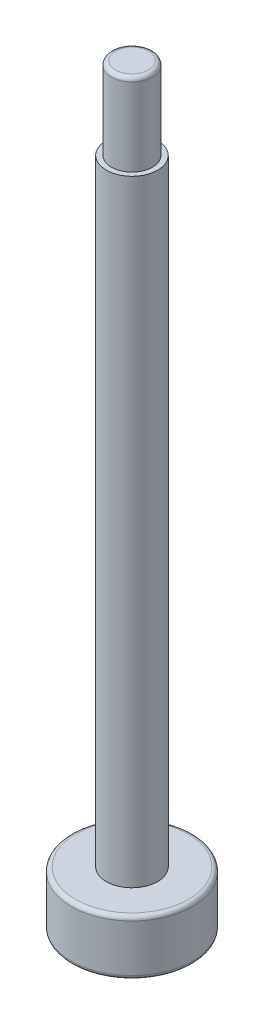
ISO-10303-21;
HEADER;
FILE_DESCRIPTION(('STEP AP214'),'2;1');
FILE_NAME('part.step','',(''),(''),'','','');
FILE_SCHEMA(('AUTOMOTIVE_DESIGN { 1 0 10303 214 1 1 1 1 }'));
ENDSEC;
DATA;
#1=APPLICATION_CONTEXT('core data for automotive mechanical design processes');
#2=APPLICATION_PROTOCOL_DEFINITION('international standard','automotive_design',2000,#1);
#3=PRODUCT_CONTEXT('',#1,'mechanical');
#4=PRODUCT('Part','Part','',(#3));
#5=PRODUCT_RELATED_PRODUCT_CATEGORY('part','',(#4));
#6=PRODUCT_DEFINITION_FORMATION('','',#4);
#7=PRODUCT_DEFINITION_CONTEXT('part definition',#1,'design');
#8=PRODUCT_DEFINITION('design','',#6,#7);
#9=PRODUCT_DEFINITION_SHAPE('','',#8);
#10=(LENGTH_UNIT() NAMED_UNIT(*) SI_UNIT(.MILLI.,.METRE.));
#11=(NAMED_UNIT(*) PLANE_ANGLE_UNIT() SI_UNIT($,.RADIAN.));
#12=(NAMED_UNIT(*) SI_UNIT($,.STERADIAN.) SOLID_ANGLE_UNIT());
#13=UNCERTAINTY_MEASURE_WITH_UNIT(LENGTH_MEASURE(1.E-05),#10,'distance_accuracy_value','');
#14=(GEOMETRIC_REPRESENTATION_CONTEXT(3) GLOBAL_UNCERTAINTY_ASSIGNED_CONTEXT((#13)) GLOBAL_UNIT_ASSIGNED_CONTEXT((#10,
#11,#12)) REPRESENTATION_CONTEXT('',''));
#15=CARTESIAN_POINT('',(0.,0.,0.));
#16=DIRECTION('',(0.,0.,1.));
#17=DIRECTION('',(1.,0.,0.));
#18=AXIS2_PLACEMENT_3D('',#15,#16,#17);
#19=CARTESIAN_POINT('',(0.,2.7,0.));
#20=DIRECTION('',(0.,-1.,0.));
#21=DIRECTION('',(0.,0.,-1.));
#22=AXIS2_PLACEMENT_3D('',#19,#20,#21);
#23=CYLINDRICAL_SURFACE('',#22,2.95);
#24=CARTESIAN_POINT('',(0.,0.2,0.));
#25=DIRECTION('',(0.,1.,0.));
#26=DIRECTION('',(0.,0.,1.));
#27=AXIS2_PLACEMENT_3D('',#24,#25,#26);
#28=CIRCLE('',#27,2.95);
#29=CARTESIAN_POINT('',(0.,0.2,2.95));
#30=VERTEX_POINT('',#29);
#31=EDGE_CURVE('E158',#30,#30,#28,.T.);
#32=ORIENTED_EDGE('',*,*,#31,.T.);
#33=EDGE_LOOP('',(#32));
#34=FACE_BOUND('',#33,.T.);
#35=CARTESIAN_POINT('',(0.,2.5,0.));
#36=DIRECTION('',(0.,1.,0.));
#37=DIRECTION('',(0.,0.,1.));
#38=AXIS2_PLACEMENT_3D('',#35,#36,#37);
#39=CIRCLE('',#38,2.95);
#40=CARTESIAN_POINT('',(0.,2.5,2.95));
#41=VERTEX_POINT('',#40);
#42=EDGE_CURVE('E150',#41,#41,#39,.F.);
#43=ORIENTED_EDGE('',*,*,#42,.T.);
#44=EDGE_LOOP('',(#43));
#45=FACE_BOUND('',#44,.T.);
#46=ADVANCED_FACE('F39',(#34,#45),#23,.T.);
#47=CARTESIAN_POINT('',(0.,2.7,0.));
#48=DIRECTION('',(0.,1.,0.));
#49=DIRECTION('',(0.,0.,1.));
#50=AXIS2_PLACEMENT_3D('',#47,#48,#49);
#51=PLANE('',#50);
#52=CARTESIAN_POINT('',(0.,2.7,0.));
#53=DIRECTION('',(0.,1.,0.));
#54=DIRECTION('',(0.,0.,1.));
#55=AXIS2_PLACEMENT_3D('',#52,#53,#54);
#56=CIRCLE('',#55,2.75);
#57=CARTESIAN_POINT('',(0.,2.7,2.75));
#58=VERTEX_POINT('',#57);
#59=EDGE_CURVE('E164',#58,#58,#56,.T.);
#60=ORIENTED_EDGE('',*,*,#59,.T.);
#61=EDGE_LOOP('',(#60));
#62=FACE_BOUND('',#61,.T.);
#63=CARTESIAN_POINT('',(0.,2.7,0.));
#64=DIRECTION('',(0.,1.,0.));
#65=DIRECTION('',(0.,0.,1.));
#66=AXIS2_PLACEMENT_3D('',#63,#64,#65);
#67=CIRCLE('',#66,1.25);
#68=CARTESIAN_POINT('',(0.,2.7,1.25));
#69=VERTEX_POINT('',#68);
#70=EDGE_CURVE('E151',#69,#69,#67,.T.);
#71=ORIENTED_EDGE('',*,*,#70,.F.);
#72=EDGE_LOOP('',(#71));
#73=FACE_BOUND('',#72,.T.);
#74=ADVANCED_FACE('F181',(#62,#73),#51,.T.);
#75=CARTESIAN_POINT('',(0.,0.,0.));
#76=DIRECTION('',(0.,1.,0.));
#77=DIRECTION('',(0.,0.,1.));
#78=AXIS2_PLACEMENT_3D('',#75,#76,#77);
#79=PLANE('',#78);
#80=CARTESIAN_POINT('',(0.,0.,0.));
#81=DIRECTION('',(0.,1.,0.));
#82=DIRECTION('',(0.,0.,1.));
#83=AXIS2_PLACEMENT_3D('',#80,#81,#82);
#84=CIRCLE('',#83,2.75);
#85=CARTESIAN_POINT('',(0.,0.,2.75));
#86=VERTEX_POINT('',#85);
#87=EDGE_CURVE('E161',#86,#86,#84,.F.);
#88=ORIENTED_EDGE('',*,*,#87,.T.);
#89=EDGE_LOOP('',(#88));
#90=FACE_BOUND('',#89,.T.);
#91=DIRECTION('',(-0.28704549437819,0.,0.95791695055322));
#92=VECTOR('',#91,1.);
#93=CARTESIAN_POINT('',(2.24728548800427,0.,-0.532016229770034));
#94=LINE('',#93,#92);
#95=CARTESIAN_POINT('',(2.24728548800427,0.,-0.532016229770034));
#96=VERTEX_POINT('',#95);
#97=CARTESIAN_POINT('',(1.58438231420861,0.,1.68019820728279));
#98=VERTEX_POINT('',#97);
#99=EDGE_CURVE('E128',#96,#98,#94,.T.);
#100=ORIENTED_EDGE('',*,*,#99,.F.);
#101=DIRECTION('',(0.686057666705715,0.,0.727547165449986));
#102=VECTOR('',#101,1.);
#103=CARTESIAN_POINT('',(0.662903173795668,0.,-2.21221443705283));
#104=LINE('',#103,#102);
#105=CARTESIAN_POINT('',(0.662903173795668,0.,-2.21221443705283));
#106=VERTEX_POINT('',#105);
#107=EDGE_CURVE('E54',#106,#96,#104,.T.);
#108=ORIENTED_EDGE('',*,*,#107,.F.);
#109=DIRECTION('',(0.973103161083906,0.,-0.230369785103234));
#110=VECTOR('',#109,1.);
#111=CARTESIAN_POINT('',(-1.58438231420861,0.,-1.68019820728279));
#112=LINE('',#111,#110);
#113=CARTESIAN_POINT('',(-1.58438231420861,0.,-1.68019820728279));
#114=VERTEX_POINT('',#113);
#115=EDGE_CURVE('E137',#114,#106,#112,.T.);
#116=ORIENTED_EDGE('',*,*,#115,.F.);
#117=DIRECTION('',(0.28704549437819,0.,-0.95791695055322));
#118=VECTOR('',#117,1.);
#119=CARTESIAN_POINT('',(-2.24728548800427,0.,0.532016229770034));
#120=LINE('',#119,#118);
#121=CARTESIAN_POINT('',(-2.24728548800427,0.,0.532016229770034));
#122=VERTEX_POINT('',#121);
#123=EDGE_CURVE('E135',#122,#114,#120,.T.);
#124=ORIENTED_EDGE('',*,*,#123,.F.);
#125=DIRECTION('',(-0.686057666705716,0.,-0.727547165449986));
#126=VECTOR('',#125,1.);
#127=CARTESIAN_POINT('',(-0.662903173795669,0.,2.21221443705283));
#128=LINE('',#127,#126);
#129=CARTESIAN_POINT('',(-0.662903173795669,0.,2.21221443705283));
#130=VERTEX_POINT('',#129);
#131=EDGE_CURVE('E102',#130,#122,#128,.T.);
#132=ORIENTED_EDGE('',*,*,#131,.F.);
#133=DIRECTION('',(-0.973103161083906,0.,0.230369785103234));
#134=VECTOR('',#133,1.);
#135=CARTESIAN_POINT('',(1.58438231420861,0.,1.68019820728279));
#136=LINE('',#135,#134);
#137=EDGE_CURVE('E131',#98,#130,#136,.T.);
#138=ORIENTED_EDGE('',*,*,#137,.F.);
#139=EDGE_LOOP('',(#100,#108,#116,#124,#132,#138));
#140=FACE_BOUND('',#139,.T.);
#141=ADVANCED_FACE('F187',(#90,#140),#79,.F.);
#142=CARTESIAN_POINT('',(0.,32.7,0.));
#143=DIRECTION('',(0.,-1.,0.));
#144=DIRECTION('',(0.,0.,-1.));
#145=AXIS2_PLACEMENT_3D('',#142,#143,#144);
#146=CYLINDRICAL_SURFACE('',#145,1.25);
#147=CARTESIAN_POINT('',(0.,32.7,0.));
#148=DIRECTION('',(0.,1.,0.));
#149=DIRECTION('',(0.,0.,1.));
#150=AXIS2_PLACEMENT_3D('',#147,#148,#149);
#151=CIRCLE('',#150,1.25);
#152=CARTESIAN_POINT('',(0.,32.7,1.25));
#153=VERTEX_POINT('',#152);
#154=EDGE_CURVE('E141',#153,#153,#151,.T.);
#155=ORIENTED_EDGE('',*,*,#154,.F.);
#156=EDGE_LOOP('',(#155));
#157=FACE_BOUND('',#156,.T.);
#158=ORIENTED_EDGE('',*,*,#70,.T.);
#159=EDGE_LOOP('',(#158));
#160=FACE_BOUND('',#159,.T.);
#161=ADVANCED_FACE('F206',(#157,#160),#146,.T.);
#162=CARTESIAN_POINT('',(0.,32.7,0.));
#163=DIRECTION('',(0.,1.,0.));
#164=DIRECTION('',(0.,0.,1.));
#165=AXIS2_PLACEMENT_3D('',#162,#163,#164);
#166=PLANE('',#165);
#167=CARTESIAN_POINT('',(0.,32.7,0.));
#168=DIRECTION('',(0.,1.,0.));
#169=DIRECTION('',(0.,0.,1.));
#170=AXIS2_PLACEMENT_3D('',#167,#168,#169);
#171=CIRCLE('',#170,1.);
#172=CARTESIAN_POINT('',(0.,32.7,1.));
#173=VERTEX_POINT('',#172);
#174=EDGE_CURVE('E147',#173,#173,#171,.T.);
#175=ORIENTED_EDGE('',*,*,#174,.F.);
#176=EDGE_LOOP('',(#175));
#177=FACE_BOUND('',#176,.T.);
#178=ORIENTED_EDGE('',*,*,#154,.T.);
#179=EDGE_LOOP('',(#178));
#180=FACE_BOUND('',#179,.T.);
#181=ADVANCED_FACE('F228',(#177,#180),#166,.T.);
#182=CARTESIAN_POINT('',(0.,36.7,0.));
#183=DIRECTION('',(0.,-1.,0.));
#184=DIRECTION('',(0.,0.,-1.));
#185=AXIS2_PLACEMENT_3D('',#182,#183,#184);
#186=CYLINDRICAL_SURFACE('',#185,1.);
#187=CARTESIAN_POINT('',(0.,36.5,0.));
#188=DIRECTION('',(0.,1.,0.));
#189=DIRECTION('',(0.,0.,1.));
#190=AXIS2_PLACEMENT_3D('',#187,#188,#189);
#191=CIRCLE('',#190,1.);
#192=CARTESIAN_POINT('',(0.,36.5,1.));
#193=VERTEX_POINT('',#192);
#194=EDGE_CURVE('E11',#193,#193,#191,.F.);
#195=ORIENTED_EDGE('',*,*,#194,.T.);
#196=EDGE_LOOP('',(#195));
#197=FACE_BOUND('',#196,.T.);
#198=ORIENTED_EDGE('',*,*,#174,.T.);
#199=EDGE_LOOP('',(#198));
#200=FACE_BOUND('',#199,.T.);
#201=ADVANCED_FACE('F221',(#197,#200),#186,.T.);
#202=CARTESIAN_POINT('',(0.,36.7,0.));
#203=DIRECTION('',(0.,1.,0.));
#204=DIRECTION('',(0.,0.,1.));
#205=AXIS2_PLACEMENT_3D('',#202,#203,#204);
#206=PLANE('',#205);
#207=CARTESIAN_POINT('',(0.,36.7,0.));
#208=DIRECTION('',(0.,1.,0.));
#209=DIRECTION('',(0.,0.,1.));
#210=AXIS2_PLACEMENT_3D('',#207,#208,#209);
#211=CIRCLE('',#210,0.8);
#212=CARTESIAN_POINT('',(0.,36.7,0.8));
#213=VERTEX_POINT('',#212);
#214=EDGE_CURVE('E47',#213,#213,#211,.T.);
#215=ORIENTED_EDGE('',*,*,#214,.T.);
#216=EDGE_LOOP('',(#215));
#217=FACE_BOUND('',#216,.T.);
#218=ADVANCED_FACE('F169',(#217),#206,.T.);
#219=CARTESIAN_POINT('',(0.662903173795668,2.,-2.21221443705283));
#220=DIRECTION('',(0.727547165449986,0.,-0.686057666705715));
#221=DIRECTION('',(-0.686057666705716,0.,-0.727547165449986));
#222=AXIS2_PLACEMENT_3D('',#219,#220,#221);
#223=PLANE('',#222);
#224=ORIENTED_EDGE('',*,*,#107,.T.);
#225=DIRECTION('',(0.,-1.,0.));
#226=VECTOR('',#225,1.);
#227=CARTESIAN_POINT('',(2.24728548800427,2.,-0.532016229770034));
#228=LINE('',#227,#226);
#229=CARTESIAN_POINT('',(2.24728548800427,2.,-0.532016229770034));
#230=VERTEX_POINT('',#229);
#231=EDGE_CURVE('E84',#230,#96,#228,.T.);
#232=ORIENTED_EDGE('',*,*,#231,.F.);
#233=DIRECTION('',(0.686057666705715,0.,0.727547165449986));
#234=VECTOR('',#233,1.);
#235=CARTESIAN_POINT('',(0.662903173795668,2.,-2.21221443705283));
#236=LINE('',#235,#234);
#237=CARTESIAN_POINT('',(0.662903173795668,2.,-2.21221443705283));
#238=VERTEX_POINT('',#237);
#239=EDGE_CURVE('E139',#238,#230,#236,.T.);
#240=ORIENTED_EDGE('',*,*,#239,.F.);
#241=DIRECTION('',(0.,-1.,0.));
#242=VECTOR('',#241,1.);
#243=CARTESIAN_POINT('',(0.662903173795668,2.,-2.21221443705283));
#244=LINE('',#243,#242);
#245=EDGE_CURVE('E62',#238,#106,#244,.T.);
#246=ORIENTED_EDGE('',*,*,#245,.T.);
#247=EDGE_LOOP('',(#224,#232,#240,#246));
#248=FACE_BOUND('',#247,.T.);
#249=ADVANCED_FACE('F212',(#248),#223,.F.);
#250=CARTESIAN_POINT('',(-1.58438231420861,2.,-1.68019820728279));
#251=DIRECTION('',(-0.230369785103234,0.,-0.973103161083906));
#252=DIRECTION('',(-0.973103161083906,0.,0.230369785103234));
#253=AXIS2_PLACEMENT_3D('',#250,#251,#252);
#254=PLANE('',#253);
#255=ORIENTED_EDGE('',*,*,#115,.T.);
#256=ORIENTED_EDGE('',*,*,#245,.F.);
#257=DIRECTION('',(0.973103161083906,0.,-0.230369785103234));
#258=VECTOR('',#257,1.);
#259=CARTESIAN_POINT('',(-1.58438231420861,2.,-1.68019820728279));
#260=LINE('',#259,#258);
#261=CARTESIAN_POINT('',(-1.58438231420861,2.,-1.68019820728279));
#262=VERTEX_POINT('',#261);
#263=EDGE_CURVE('E114',#262,#238,#260,.T.);
#264=ORIENTED_EDGE('',*,*,#263,.F.);
#265=DIRECTION('',(0.,-1.,0.));
#266=VECTOR('',#265,1.);
#267=CARTESIAN_POINT('',(-1.58438231420861,2.,-1.68019820728279));
#268=LINE('',#267,#266);
#269=EDGE_CURVE('E106',#262,#114,#268,.T.);
#270=ORIENTED_EDGE('',*,*,#269,.T.);
#271=EDGE_LOOP('',(#255,#256,#264,#270));
#272=FACE_BOUND('',#271,.T.);
#273=ADVANCED_FACE('F214',(#272),#254,.F.);
#274=CARTESIAN_POINT('',(-2.24728548800427,2.,0.532016229770034));
#275=DIRECTION('',(-0.95791695055322,0.,-0.28704549437819));
#276=DIRECTION('',(-0.28704549437819,0.,0.95791695055322));
#277=AXIS2_PLACEMENT_3D('',#274,#275,#276);
#278=PLANE('',#277);
#279=ORIENTED_EDGE('',*,*,#123,.T.);
#280=ORIENTED_EDGE('',*,*,#269,.F.);
#281=DIRECTION('',(0.28704549437819,0.,-0.95791695055322));
#282=VECTOR('',#281,1.);
#283=CARTESIAN_POINT('',(-2.24728548800427,2.,0.532016229770034));
#284=LINE('',#283,#282);
#285=CARTESIAN_POINT('',(-2.24728548800427,2.,0.532016229770034));
#286=VERTEX_POINT('',#285);
#287=EDGE_CURVE('E110',#286,#262,#284,.T.);
#288=ORIENTED_EDGE('',*,*,#287,.F.);
#289=DIRECTION('',(0.,-1.,0.));
#290=VECTOR('',#289,1.);
#291=CARTESIAN_POINT('',(-2.24728548800427,2.,0.532016229770034));
#292=LINE('',#291,#290);
#293=EDGE_CURVE('E95',#286,#122,#292,.T.);
#294=ORIENTED_EDGE('',*,*,#293,.T.);
#295=EDGE_LOOP('',(#279,#280,#288,#294));
#296=FACE_BOUND('',#295,.T.);
#297=ADVANCED_FACE('F111',(#296),#278,.F.);
#298=CARTESIAN_POINT('',(-0.662903173795669,2.,2.21221443705283));
#299=DIRECTION('',(-0.727547165449986,0.,0.686057666705716));
#300=DIRECTION('',(0.686057666705716,0.,0.727547165449986));
#301=AXIS2_PLACEMENT_3D('',#298,#299,#300);
#302=PLANE('',#301);
#303=ORIENTED_EDGE('',*,*,#131,.T.);
#304=ORIENTED_EDGE('',*,*,#293,.F.);
#305=DIRECTION('',(-0.686057666705716,0.,-0.727547165449986));
#306=VECTOR('',#305,1.);
#307=CARTESIAN_POINT('',(-0.662903173795669,2.,2.21221443705283));
#308=LINE('',#307,#306);
#309=CARTESIAN_POINT('',(-0.662903173795669,2.,2.21221443705283));
#310=VERTEX_POINT('',#309);
#311=EDGE_CURVE('E99',#310,#286,#308,.T.);
#312=ORIENTED_EDGE('',*,*,#311,.F.);
#313=DIRECTION('',(0.,-1.,0.));
#314=VECTOR('',#313,1.);
#315=CARTESIAN_POINT('',(-0.662903173795669,2.,2.21221443705283));
#316=LINE('',#315,#314);
#317=EDGE_CURVE('E107',#310,#130,#316,.T.);
#318=ORIENTED_EDGE('',*,*,#317,.T.);
#319=EDGE_LOOP('',(#303,#304,#312,#318));
#320=FACE_BOUND('',#319,.T.);
#321=ADVANCED_FACE('F97',(#320),#302,.F.);
#322=CARTESIAN_POINT('',(1.58438231420861,2.,1.68019820728279));
#323=DIRECTION('',(0.230369785103234,0.,0.973103161083906));
#324=DIRECTION('',(0.973103161083906,0.,-0.230369785103234));
#325=AXIS2_PLACEMENT_3D('',#322,#323,#324);
#326=PLANE('',#325);
#327=ORIENTED_EDGE('',*,*,#137,.T.);
#328=ORIENTED_EDGE('',*,*,#317,.F.);
#329=DIRECTION('',(-0.973103161083906,0.,0.230369785103234));
#330=VECTOR('',#329,1.);
#331=CARTESIAN_POINT('',(1.58438231420861,2.,1.68019820728279));
#332=LINE('',#331,#330);
#333=CARTESIAN_POINT('',(1.58438231420861,2.,1.68019820728279));
#334=VERTEX_POINT('',#333);
#335=EDGE_CURVE('E120',#334,#310,#332,.T.);
#336=ORIENTED_EDGE('',*,*,#335,.F.);
#337=DIRECTION('',(0.,-1.,0.));
#338=VECTOR('',#337,1.);
#339=CARTESIAN_POINT('',(1.58438231420861,2.,1.68019820728279));
#340=LINE('',#339,#338);
#341=EDGE_CURVE('E144',#334,#98,#340,.T.);
#342=ORIENTED_EDGE('',*,*,#341,.T.);
#343=EDGE_LOOP('',(#327,#328,#336,#342));
#344=FACE_BOUND('',#343,.T.);
#345=ADVANCED_FACE('F286',(#344),#326,.F.);
#346=CARTESIAN_POINT('',(2.24728548800427,2.,-0.532016229770034));
#347=DIRECTION('',(0.95791695055322,0.,0.28704549437819));
#348=DIRECTION('',(0.28704549437819,0.,-0.95791695055322));
#349=AXIS2_PLACEMENT_3D('',#346,#347,#348);
#350=PLANE('',#349);
#351=ORIENTED_EDGE('',*,*,#99,.T.);
#352=ORIENTED_EDGE('',*,*,#341,.F.);
#353=DIRECTION('',(-0.28704549437819,0.,0.95791695055322));
#354=VECTOR('',#353,1.);
#355=CARTESIAN_POINT('',(2.24728548800427,2.,-0.532016229770034));
#356=LINE('',#355,#354);
#357=EDGE_CURVE('E122',#230,#334,#356,.T.);
#358=ORIENTED_EDGE('',*,*,#357,.F.);
#359=ORIENTED_EDGE('',*,*,#231,.T.);
#360=EDGE_LOOP('',(#351,#352,#358,#359));
#361=FACE_BOUND('',#360,.T.);
#362=ADVANCED_FACE('F198',(#361),#350,.F.);
#363=CARTESIAN_POINT('',(0.,2.,0.));
#364=DIRECTION('',(0.,-1.,0.));
#365=DIRECTION('',(0.,0.,-1.));
#366=AXIS2_PLACEMENT_3D('',#363,#364,#365);
#367=PLANE('',#366);
#368=ORIENTED_EDGE('',*,*,#239,.T.);
#369=ORIENTED_EDGE('',*,*,#357,.T.);
#370=ORIENTED_EDGE('',*,*,#335,.T.);
#371=ORIENTED_EDGE('',*,*,#311,.T.);
#372=ORIENTED_EDGE('',*,*,#287,.T.);
#373=ORIENTED_EDGE('',*,*,#263,.T.);
#374=EDGE_LOOP('',(#368,#369,#370,#371,#372,#373));
#375=FACE_BOUND('',#374,.T.);
#376=ADVANCED_FACE('F117',(#375),#367,.T.);
#377=CARTESIAN_POINT('',(0.,0.2,0.));
#378=DIRECTION('',(0.,1.,0.));
#379=DIRECTION('',(0.,0.,1.));
#380=AXIS2_PLACEMENT_3D('',#377,#378,#379);
#381=TOROIDAL_SURFACE('',#380,2.75,0.2);
#382=ORIENTED_EDGE('',*,*,#87,.F.);
#383=EDGE_LOOP('',(#382));
#384=FACE_BOUND('',#383,.T.);
#385=ORIENTED_EDGE('',*,*,#31,.F.);
#386=EDGE_LOOP('',(#385));
#387=FACE_BOUND('',#386,.T.);
#388=ADVANCED_FACE('F177',(#384,#387),#381,.T.);
#389=CARTESIAN_POINT('',(0.,2.5,0.));
#390=DIRECTION('',(0.,1.,0.));
#391=DIRECTION('',(0.,0.,1.));
#392=AXIS2_PLACEMENT_3D('',#389,#390,#391);
#393=TOROIDAL_SURFACE('',#392,2.75,0.2);
#394=ORIENTED_EDGE('',*,*,#42,.F.);
#395=EDGE_LOOP('',(#394));
#396=FACE_BOUND('',#395,.T.);
#397=ORIENTED_EDGE('',*,*,#59,.F.);
#398=EDGE_LOOP('',(#397));
#399=FACE_BOUND('',#398,.T.);
#400=ADVANCED_FACE('F172',(#396,#399),#393,.T.);
#401=CARTESIAN_POINT('',(0.,36.5,0.));
#402=DIRECTION('',(0.,1.,0.));
#403=DIRECTION('',(0.,0.,1.));
#404=AXIS2_PLACEMENT_3D('',#401,#402,#403);
#405=TOROIDAL_SURFACE('',#404,0.8,0.2);
#406=ORIENTED_EDGE('',*,*,#194,.F.);
#407=EDGE_LOOP('',(#406));
#408=FACE_BOUND('',#407,.T.);
#409=ORIENTED_EDGE('',*,*,#214,.F.);
#410=EDGE_LOOP('',(#409));
#411=FACE_BOUND('',#410,.T.);
#412=ADVANCED_FACE('F41',(#408,#411),#405,.T.);
#413=CLOSED_SHELL('',(#46,#74,#141,#161,#181,#201,#218,#249,#273,#297,#321,#345,#362,#376,#388,
#400,#412));
#414=MANIFOLD_SOLID_BREP('B2',#413);
#415=ADVANCED_BREP_SHAPE_REPRESENTATION('',(#18,#414),#14);
#416=SHAPE_DEFINITION_REPRESENTATION(#9,#415);
ENDSEC;
END-ISO-10303-21;
